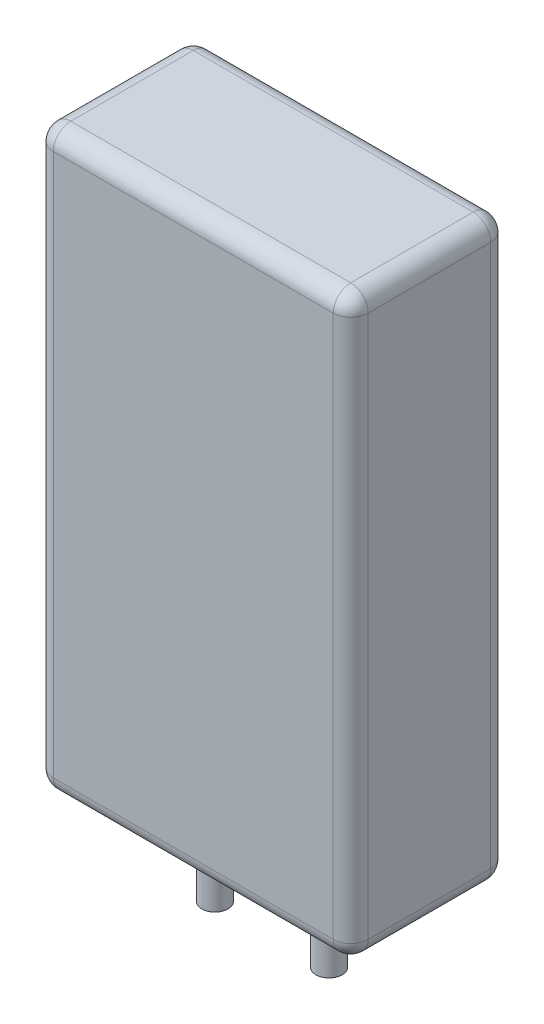
ISO-10303-21;
HEADER;
FILE_DESCRIPTION(('STEP AP214'),'2;1');
FILE_NAME('part.step','',(''),(''),'','','');
FILE_SCHEMA(('AUTOMOTIVE_DESIGN { 1 0 10303 214 1 1 1 1 }'));
ENDSEC;
DATA;
#1=APPLICATION_CONTEXT('core data for automotive mechanical design processes');
#2=APPLICATION_PROTOCOL_DEFINITION('international standard','automotive_design',2000,#1);
#3=PRODUCT_CONTEXT('',#1,'mechanical');
#4=PRODUCT('Part','Part','',(#3));
#5=PRODUCT_RELATED_PRODUCT_CATEGORY('part','',(#4));
#6=PRODUCT_DEFINITION_FORMATION('','',#4);
#7=PRODUCT_DEFINITION_CONTEXT('part definition',#1,'design');
#8=PRODUCT_DEFINITION('design','',#6,#7);
#9=PRODUCT_DEFINITION_SHAPE('','',#8);
#10=(LENGTH_UNIT() NAMED_UNIT(*) SI_UNIT(.MILLI.,.METRE.));
#11=(NAMED_UNIT(*) PLANE_ANGLE_UNIT() SI_UNIT($,.RADIAN.));
#12=(NAMED_UNIT(*) SI_UNIT($,.STERADIAN.) SOLID_ANGLE_UNIT());
#13=UNCERTAINTY_MEASURE_WITH_UNIT(LENGTH_MEASURE(1.E-05),#10,'distance_accuracy_value','');
#14=(GEOMETRIC_REPRESENTATION_CONTEXT(3) GLOBAL_UNCERTAINTY_ASSIGNED_CONTEXT((#13)) GLOBAL_UNIT_ASSIGNED_CONTEXT((#10,
#11,#12)) REPRESENTATION_CONTEXT('',''));
#15=CARTESIAN_POINT('',(0.,0.,0.));
#16=DIRECTION('',(0.,0.,1.));
#17=DIRECTION('',(1.,0.,0.));
#18=AXIS2_PLACEMENT_3D('',#15,#16,#17);
#19=CARTESIAN_POINT('',(-18.4862649870996,-22.2644628099174,18.));
#20=DIRECTION('',(0.,1.,0.));
#21=DIRECTION('',(0.,0.,1.));
#22=AXIS2_PLACEMENT_3D('',#19,#20,#21);
#23=PLANE('',#22);
#24=CARTESIAN_POINT('',(-7.00866391965159,-22.2644628099174,9.00000000000001));
#25=DIRECTION('',(0.,1.,0.));
#26=DIRECTION('',(0.,0.,1.));
#27=AXIS2_PLACEMENT_3D('',#24,#25,#26);
#28=CIRCLE('',#27,2.);
#29=CARTESIAN_POINT('',(-7.00866391965159,-22.2644628099174,11.));
#30=VERTEX_POINT('',#29);
#31=EDGE_CURVE('E42',#30,#30,#28,.F.);
#32=ORIENTED_EDGE('',*,*,#31,.F.);
#33=EDGE_LOOP('',(#32));
#34=FACE_BOUND('',#33,.T.);
#35=DIRECTION('',(0.,0.,-1.));
#36=VECTOR('',#35,1.);
#37=CARTESIAN_POINT('',(-16.4862649870996,-22.2644628099174,18.));
#38=LINE('',#37,#36);
#39=CARTESIAN_POINT('',(-16.4862649870996,-22.2644628099174,16.));
#40=VERTEX_POINT('',#39);
#41=CARTESIAN_POINT('',(-16.4862649870997,-22.2644628099174,2.));
#42=VERTEX_POINT('',#41);
#43=EDGE_CURVE('E158',#40,#42,#38,.T.);
#44=ORIENTED_EDGE('',*,*,#43,.T.);
#45=DIRECTION('',(1.,0.,0.));
#46=VECTOR('',#45,1.);
#47=CARTESIAN_POINT('',(-18.4862649870997,-22.2644628099174,2.));
#48=LINE('',#47,#46);
#49=CARTESIAN_POINT('',(15.5137350129003,-22.2644628099174,2.));
#50=VERTEX_POINT('',#49);
#51=EDGE_CURVE('E128',#42,#50,#48,.T.);
#52=ORIENTED_EDGE('',*,*,#51,.T.);
#53=DIRECTION('',(0.,0.,-1.));
#54=VECTOR('',#53,1.);
#55=CARTESIAN_POINT('',(15.5137350129003,-22.2644628099174,18.));
#56=LINE('',#55,#54);
#57=CARTESIAN_POINT('',(15.5137350129003,-22.2644628099174,16.));
#58=VERTEX_POINT('',#57);
#59=EDGE_CURVE('E147',#50,#58,#56,.F.);
#60=ORIENTED_EDGE('',*,*,#59,.T.);
#61=DIRECTION('',(1.,0.,0.));
#62=VECTOR('',#61,1.);
#63=CARTESIAN_POINT('',(-18.4862649870996,-22.2644628099174,16.));
#64=LINE('',#63,#62);
#65=EDGE_CURVE('E153',#58,#40,#64,.F.);
#66=ORIENTED_EDGE('',*,*,#65,.T.);
#67=EDGE_LOOP('',(#44,#52,#60,#66));
#68=FACE_BOUND('',#67,.T.);
#69=CARTESIAN_POINT('',(6.03613394545222,-22.2644628099174,9.00000000000001));
#70=DIRECTION('',(0.,1.,0.));
#71=DIRECTION('',(0.,0.,1.));
#72=AXIS2_PLACEMENT_3D('',#69,#70,#71);
#73=CIRCLE('',#72,2.);
#74=CARTESIAN_POINT('',(6.03613394545222,-22.2644628099174,11.));
#75=VERTEX_POINT('',#74);
#76=EDGE_CURVE('E11',#75,#75,#73,.F.);
#77=ORIENTED_EDGE('',*,*,#76,.F.);
#78=EDGE_LOOP('',(#77));
#79=FACE_BOUND('',#78,.T.);
#80=ADVANCED_FACE('F34',(#34,#68,#79),#23,.F.);
#81=CARTESIAN_POINT('',(-18.4862649870997,43.7355371900826,18.));
#82=DIRECTION('',(1.,0.,0.));
#83=DIRECTION('',(0.,1.,0.));
#84=AXIS2_PLACEMENT_3D('',#81,#82,#83);
#85=PLANE('',#84);
#86=DIRECTION('',(0.,-1.,0.));
#87=VECTOR('',#86,1.);
#88=CARTESIAN_POINT('',(-18.4862649870997,43.7355371900826,2.));
#89=LINE('',#88,#87);
#90=CARTESIAN_POINT('',(-18.4862649870997,41.7355371900826,2.));
#91=VERTEX_POINT('',#90);
#92=CARTESIAN_POINT('',(-18.4862649870997,-20.2644628099174,2.));
#93=VERTEX_POINT('',#92);
#94=EDGE_CURVE('E175',#91,#93,#89,.T.);
#95=ORIENTED_EDGE('',*,*,#94,.T.);
#96=DIRECTION('',(0.,0.,-1.));
#97=VECTOR('',#96,1.);
#98=CARTESIAN_POINT('',(-18.4862649870996,-20.2644628099174,18.));
#99=LINE('',#98,#97);
#100=CARTESIAN_POINT('',(-18.4862649870996,-20.2644628099174,16.));
#101=VERTEX_POINT('',#100);
#102=EDGE_CURVE('E177',#93,#101,#99,.F.);
#103=ORIENTED_EDGE('',*,*,#102,.T.);
#104=DIRECTION('',(0.,-1.,0.));
#105=VECTOR('',#104,1.);
#106=CARTESIAN_POINT('',(-18.4862649870997,43.7355371900826,16.));
#107=LINE('',#106,#105);
#108=CARTESIAN_POINT('',(-18.4862649870997,41.7355371900826,16.));
#109=VERTEX_POINT('',#108);
#110=EDGE_CURVE('E171',#101,#109,#107,.F.);
#111=ORIENTED_EDGE('',*,*,#110,.T.);
#112=DIRECTION('',(0.,0.,-1.));
#113=VECTOR('',#112,1.);
#114=CARTESIAN_POINT('',(-18.4862649870997,41.7355371900826,18.));
#115=LINE('',#114,#113);
#116=EDGE_CURVE('E173',#109,#91,#115,.T.);
#117=ORIENTED_EDGE('',*,*,#116,.T.);
#118=EDGE_LOOP('',(#95,#103,#111,#117));
#119=FACE_BOUND('',#118,.T.);
#120=ADVANCED_FACE('F264',(#119),#85,.F.);
#121=CARTESIAN_POINT('',(17.5137350129003,43.7355371900826,18.));
#122=DIRECTION('',(-1.,0.,0.));
#123=DIRECTION('',(0.,-1.,0.));
#124=AXIS2_PLACEMENT_3D('',#121,#122,#123);
#125=PLANE('',#124);
#126=DIRECTION('',(0.,1.,0.));
#127=VECTOR('',#126,1.);
#128=CARTESIAN_POINT('',(17.5137350129003,-22.2644628099174,16.));
#129=LINE('',#128,#127);
#130=CARTESIAN_POINT('',(17.5137350129003,41.7355371900826,16.));
#131=VERTEX_POINT('',#130);
#132=CARTESIAN_POINT('',(17.5137350129003,-20.2644628099174,16.));
#133=VERTEX_POINT('',#132);
#134=EDGE_CURVE('E49',#131,#133,#129,.F.);
#135=ORIENTED_EDGE('',*,*,#134,.T.);
#136=DIRECTION('',(0.,0.,-1.));
#137=VECTOR('',#136,1.);
#138=CARTESIAN_POINT('',(17.5137350129003,-20.2644628099174,18.));
#139=LINE('',#138,#137);
#140=CARTESIAN_POINT('',(17.5137350129003,-20.2644628099174,2.));
#141=VERTEX_POINT('',#140);
#142=EDGE_CURVE('E202',#133,#141,#139,.T.);
#143=ORIENTED_EDGE('',*,*,#142,.T.);
#144=DIRECTION('',(0.,1.,0.));
#145=VECTOR('',#144,1.);
#146=CARTESIAN_POINT('',(17.5137350129003,43.7355371900826,2.));
#147=LINE('',#146,#145);
#148=CARTESIAN_POINT('',(17.5137350129003,41.7355371900826,2.));
#149=VERTEX_POINT('',#148);
#150=EDGE_CURVE('E198',#141,#149,#147,.T.);
#151=ORIENTED_EDGE('',*,*,#150,.T.);
#152=DIRECTION('',(0.,0.,-1.));
#153=VECTOR('',#152,1.);
#154=CARTESIAN_POINT('',(17.5137350129003,41.7355371900826,18.));
#155=LINE('',#154,#153);
#156=EDGE_CURVE('E54',#149,#131,#155,.F.);
#157=ORIENTED_EDGE('',*,*,#156,.T.);
#158=EDGE_LOOP('',(#135,#143,#151,#157));
#159=FACE_BOUND('',#158,.T.);
#160=ADVANCED_FACE('F269',(#159),#125,.F.);
#161=CARTESIAN_POINT('',(-18.4862649870997,43.7355371900826,18.));
#162=DIRECTION('',(0.,-1.,0.));
#163=DIRECTION('',(0.,0.,-1.));
#164=AXIS2_PLACEMENT_3D('',#161,#162,#163);
#165=PLANE('',#164);
#166=DIRECTION('',(-1.,0.,0.));
#167=VECTOR('',#166,1.);
#168=CARTESIAN_POINT('',(-18.4862649870997,43.7355371900826,2.));
#169=LINE('',#168,#167);
#170=CARTESIAN_POINT('',(15.5137350129003,43.7355371900826,2.));
#171=VERTEX_POINT('',#170);
#172=CARTESIAN_POINT('',(-16.4862649870997,43.7355371900826,2.));
#173=VERTEX_POINT('',#172);
#174=EDGE_CURVE('E184',#171,#173,#169,.T.);
#175=ORIENTED_EDGE('',*,*,#174,.T.);
#176=DIRECTION('',(0.,0.,-1.));
#177=VECTOR('',#176,1.);
#178=CARTESIAN_POINT('',(-16.4862649870997,43.7355371900826,18.));
#179=LINE('',#178,#177);
#180=CARTESIAN_POINT('',(-16.4862649870997,43.7355371900826,16.));
#181=VERTEX_POINT('',#180);
#182=EDGE_CURVE('E186',#173,#181,#179,.F.);
#183=ORIENTED_EDGE('',*,*,#182,.T.);
#184=DIRECTION('',(-1.,0.,0.));
#185=VECTOR('',#184,1.);
#186=CARTESIAN_POINT('',(17.5137350129003,43.7355371900826,16.));
#187=LINE('',#186,#185);
#188=CARTESIAN_POINT('',(15.5137350129003,43.7355371900826,16.));
#189=VERTEX_POINT('',#188);
#190=EDGE_CURVE('E182',#181,#189,#187,.F.);
#191=ORIENTED_EDGE('',*,*,#190,.T.);
#192=DIRECTION('',(0.,0.,-1.));
#193=VECTOR('',#192,1.);
#194=CARTESIAN_POINT('',(15.5137350129003,43.7355371900826,18.));
#195=LINE('',#194,#193);
#196=EDGE_CURVE('E180',#189,#171,#195,.T.);
#197=ORIENTED_EDGE('',*,*,#196,.T.);
#198=EDGE_LOOP('',(#175,#183,#191,#197));
#199=FACE_BOUND('',#198,.T.);
#200=ADVANCED_FACE('F378',(#199),#165,.F.);
#201=CARTESIAN_POINT('',(0.,0.,18.));
#202=DIRECTION('',(0.,0.,1.));
#203=DIRECTION('',(1.,0.,0.));
#204=AXIS2_PLACEMENT_3D('',#201,#202,#203);
#205=PLANE('',#204);
#206=DIRECTION('',(-1.,0.,0.));
#207=VECTOR('',#206,1.);
#208=CARTESIAN_POINT('',(-18.4862649870997,41.7355371900826,18.));
#209=LINE('',#208,#207);
#210=CARTESIAN_POINT('',(15.5137350129003,41.7355371900826,18.));
#211=VERTEX_POINT('',#210);
#212=CARTESIAN_POINT('',(-16.4862649870997,41.7355371900826,18.));
#213=VERTEX_POINT('',#212);
#214=EDGE_CURVE('E193',#211,#213,#209,.T.);
#215=ORIENTED_EDGE('',*,*,#214,.T.);
#216=DIRECTION('',(0.,-1.,0.));
#217=VECTOR('',#216,1.);
#218=CARTESIAN_POINT('',(-16.4862649870996,-22.2644628099174,18.));
#219=LINE('',#218,#217);
#220=CARTESIAN_POINT('',(-16.4862649870996,-20.2644628099174,18.));
#221=VERTEX_POINT('',#220);
#222=EDGE_CURVE('E196',#213,#221,#219,.T.);
#223=ORIENTED_EDGE('',*,*,#222,.T.);
#224=DIRECTION('',(1.,0.,0.));
#225=VECTOR('',#224,1.);
#226=CARTESIAN_POINT('',(17.5137350129003,-20.2644628099174,18.));
#227=LINE('',#226,#225);
#228=CARTESIAN_POINT('',(15.5137350129003,-20.2644628099174,18.));
#229=VERTEX_POINT('',#228);
#230=EDGE_CURVE('E191',#221,#229,#227,.T.);
#231=ORIENTED_EDGE('',*,*,#230,.T.);
#232=DIRECTION('',(0.,1.,0.));
#233=VECTOR('',#232,1.);
#234=CARTESIAN_POINT('',(15.5137350129003,43.7355371900826,18.));
#235=LINE('',#234,#233);
#236=EDGE_CURVE('E189',#229,#211,#235,.T.);
#237=ORIENTED_EDGE('',*,*,#236,.T.);
#238=EDGE_LOOP('',(#215,#223,#231,#237));
#239=FACE_BOUND('',#238,.T.);
#240=ADVANCED_FACE('F358',(#239),#205,.T.);
#241=CARTESIAN_POINT('',(0.,0.,0.));
#242=DIRECTION('',(0.,0.,1.));
#243=DIRECTION('',(1.,0.,0.));
#244=AXIS2_PLACEMENT_3D('',#241,#242,#243);
#245=PLANE('',#244);
#246=DIRECTION('',(0.,1.,0.));
#247=VECTOR('',#246,1.);
#248=CARTESIAN_POINT('',(15.5137350129003,0.,0.));
#249=LINE('',#248,#247);
#250=CARTESIAN_POINT('',(15.5137350129003,41.7355371900826,0.));
#251=VERTEX_POINT('',#250);
#252=CARTESIAN_POINT('',(15.5137350129003,-20.2644628099174,0.));
#253=VERTEX_POINT('',#252);
#254=EDGE_CURVE('E160',#251,#253,#249,.F.);
#255=ORIENTED_EDGE('',*,*,#254,.T.);
#256=DIRECTION('',(1.,0.,0.));
#257=VECTOR('',#256,1.);
#258=CARTESIAN_POINT('',(0.,-20.2644628099174,0.));
#259=LINE('',#258,#257);
#260=CARTESIAN_POINT('',(-16.4862649870997,-20.2644628099174,0.));
#261=VERTEX_POINT('',#260);
#262=EDGE_CURVE('E130',#253,#261,#259,.F.);
#263=ORIENTED_EDGE('',*,*,#262,.T.);
#264=DIRECTION('',(0.,-1.,0.));
#265=VECTOR('',#264,1.);
#266=CARTESIAN_POINT('',(-16.4862649870997,0.,0.));
#267=LINE('',#266,#265);
#268=CARTESIAN_POINT('',(-16.4862649870997,41.7355371900826,0.));
#269=VERTEX_POINT('',#268);
#270=EDGE_CURVE('E168',#261,#269,#267,.F.);
#271=ORIENTED_EDGE('',*,*,#270,.T.);
#272=DIRECTION('',(-1.,0.,0.));
#273=VECTOR('',#272,1.);
#274=CARTESIAN_POINT('',(0.,41.7355371900826,0.));
#275=LINE('',#274,#273);
#276=EDGE_CURVE('E162',#269,#251,#275,.F.);
#277=ORIENTED_EDGE('',*,*,#276,.T.);
#278=EDGE_LOOP('',(#255,#263,#271,#277));
#279=FACE_BOUND('',#278,.T.);
#280=ADVANCED_FACE('F347',(#279),#245,.F.);
#281=CARTESIAN_POINT('',(0.,41.7355371900826,16.));
#282=DIRECTION('',(1.,0.,0.));
#283=DIRECTION('',(0.,0.,-1.));
#284=AXIS2_PLACEMENT_3D('',#281,#282,#283);
#285=CYLINDRICAL_SURFACE('',#284,2.);
#286=CARTESIAN_POINT('',(-16.4862649870997,41.7355371900826,16.));
#287=DIRECTION('',(-1.,0.,0.));
#288=DIRECTION('',(0.,0.,1.));
#289=AXIS2_PLACEMENT_3D('',#286,#287,#288);
#290=CIRCLE('',#289,2.);
#291=EDGE_CURVE('E154',#213,#181,#290,.T.);
#292=ORIENTED_EDGE('',*,*,#291,.F.);
#293=ORIENTED_EDGE('',*,*,#214,.F.);
#294=CARTESIAN_POINT('',(15.5137350129003,41.7355371900826,16.));
#295=DIRECTION('',(1.,0.,0.));
#296=DIRECTION('',(0.,0.,-1.));
#297=AXIS2_PLACEMENT_3D('',#294,#295,#296);
#298=CIRCLE('',#297,2.);
#299=EDGE_CURVE('E254',#189,#211,#298,.T.);
#300=ORIENTED_EDGE('',*,*,#299,.F.);
#301=ORIENTED_EDGE('',*,*,#190,.F.);
#302=EDGE_LOOP('',(#292,#293,#300,#301));
#303=FACE_BOUND('',#302,.T.);
#304=ADVANCED_FACE('F36',(#303),#285,.T.);
#305=CARTESIAN_POINT('',(-16.4862649870997,41.7355371900826,16.));
#306=DIRECTION('',(0.,0.,1.));
#307=DIRECTION('',(1.,0.,0.));
#308=AXIS2_PLACEMENT_3D('',#305,#306,#307);
#309=SPHERICAL_SURFACE('',#308,2.);
#310=CARTESIAN_POINT('',(-16.4862649870997,41.7355371900826,16.));
#311=DIRECTION('',(0.,1.,0.));
#312=DIRECTION('',(0.,0.,1.));
#313=AXIS2_PLACEMENT_3D('',#310,#311,#312);
#314=CIRCLE('',#313,2.);
#315=EDGE_CURVE('E249',#213,#109,#314,.F.);
#316=ORIENTED_EDGE('',*,*,#315,.F.);
#317=ORIENTED_EDGE('',*,*,#291,.T.);
#318=CARTESIAN_POINT('',(-16.4862649870997,41.7355371900826,16.));
#319=DIRECTION('',(0.,0.,1.));
#320=DIRECTION('',(1.,0.,0.));
#321=AXIS2_PLACEMENT_3D('',#318,#319,#320);
#322=CIRCLE('',#321,2.);
#323=EDGE_CURVE('E252',#109,#181,#322,.F.);
#324=ORIENTED_EDGE('',*,*,#323,.F.);
#325=EDGE_LOOP('',(#316,#317,#324));
#326=FACE_BOUND('',#325,.T.);
#327=ADVANCED_FACE('F340',(#326),#309,.T.);
#328=CARTESIAN_POINT('',(15.5137350129003,41.7355371900826,16.));
#329=DIRECTION('',(0.,0.,1.));
#330=DIRECTION('',(1.,0.,0.));
#331=AXIS2_PLACEMENT_3D('',#328,#329,#330);
#332=SPHERICAL_SURFACE('',#331,2.);
#333=CARTESIAN_POINT('',(15.5137350129003,41.7355371900826,16.));
#334=DIRECTION('',(0.,0.,1.));
#335=DIRECTION('',(1.,0.,0.));
#336=AXIS2_PLACEMENT_3D('',#333,#334,#335);
#337=CIRCLE('',#336,2.);
#338=EDGE_CURVE('E244',#189,#131,#337,.F.);
#339=ORIENTED_EDGE('',*,*,#338,.F.);
#340=ORIENTED_EDGE('',*,*,#299,.T.);
#341=CARTESIAN_POINT('',(15.5137350129003,41.7355371900826,16.));
#342=DIRECTION('',(0.,1.,0.));
#343=DIRECTION('',(0.,0.,1.));
#344=AXIS2_PLACEMENT_3D('',#341,#342,#343);
#345=CIRCLE('',#344,2.);
#346=EDGE_CURVE('E246',#131,#211,#345,.F.);
#347=ORIENTED_EDGE('',*,*,#346,.F.);
#348=EDGE_LOOP('',(#339,#340,#347));
#349=FACE_BOUND('',#348,.T.);
#350=ADVANCED_FACE('F337',(#349),#332,.T.);
#351=CARTESIAN_POINT('',(-16.4862649870997,41.7355371900826,18.));
#352=DIRECTION('',(0.,0.,-1.));
#353=DIRECTION('',(-1.,0.,0.));
#354=AXIS2_PLACEMENT_3D('',#351,#352,#353);
#355=CYLINDRICAL_SURFACE('',#354,2.);
#356=ORIENTED_EDGE('',*,*,#323,.T.);
#357=ORIENTED_EDGE('',*,*,#182,.F.);
#358=CARTESIAN_POINT('',(-16.4862649870997,41.7355371900826,2.));
#359=DIRECTION('',(0.,0.,-1.));
#360=DIRECTION('',(-1.,0.,0.));
#361=AXIS2_PLACEMENT_3D('',#358,#359,#360);
#362=CIRCLE('',#361,2.);
#363=EDGE_CURVE('E238',#91,#173,#362,.T.);
#364=ORIENTED_EDGE('',*,*,#363,.F.);
#365=ORIENTED_EDGE('',*,*,#116,.F.);
#366=EDGE_LOOP('',(#356,#357,#364,#365));
#367=FACE_BOUND('',#366,.T.);
#368=ADVANCED_FACE('F333',(#367),#355,.T.);
#369=CARTESIAN_POINT('',(-16.4862649870997,0.,16.));
#370=DIRECTION('',(0.,1.,0.));
#371=DIRECTION('',(-1.,0.,0.));
#372=AXIS2_PLACEMENT_3D('',#369,#370,#371);
#373=CYLINDRICAL_SURFACE('',#372,2.);
#374=ORIENTED_EDGE('',*,*,#315,.T.);
#375=ORIENTED_EDGE('',*,*,#110,.F.);
#376=CARTESIAN_POINT('',(-16.4862649870996,-20.2644628099174,16.));
#377=DIRECTION('',(0.,-1.,0.));
#378=DIRECTION('',(0.,0.,-1.));
#379=AXIS2_PLACEMENT_3D('',#376,#377,#378);
#380=CIRCLE('',#379,2.);
#381=EDGE_CURVE('E235',#221,#101,#380,.T.);
#382=ORIENTED_EDGE('',*,*,#381,.F.);
#383=ORIENTED_EDGE('',*,*,#222,.F.);
#384=EDGE_LOOP('',(#374,#375,#382,#383));
#385=FACE_BOUND('',#384,.T.);
#386=ADVANCED_FACE('F329',(#385),#373,.T.);
#387=CARTESIAN_POINT('',(0.,-20.2644628099174,16.));
#388=DIRECTION('',(-1.,0.,0.));
#389=DIRECTION('',(0.,0.,1.));
#390=AXIS2_PLACEMENT_3D('',#387,#388,#389);
#391=CYLINDRICAL_SURFACE('',#390,2.);
#392=CARTESIAN_POINT('',(15.5137350129003,-20.2644628099174,16.));
#393=DIRECTION('',(1.,0.,0.));
#394=DIRECTION('',(0.,0.,-1.));
#395=AXIS2_PLACEMENT_3D('',#392,#393,#394);
#396=CIRCLE('',#395,2.);
#397=EDGE_CURVE('E229',#229,#58,#396,.T.);
#398=ORIENTED_EDGE('',*,*,#397,.F.);
#399=ORIENTED_EDGE('',*,*,#230,.F.);
#400=CARTESIAN_POINT('',(-16.4862649870996,-20.2644628099174,16.));
#401=DIRECTION('',(-1.,0.,0.));
#402=DIRECTION('',(0.,0.,1.));
#403=AXIS2_PLACEMENT_3D('',#400,#401,#402);
#404=CIRCLE('',#403,2.);
#405=EDGE_CURVE('E232',#40,#221,#404,.T.);
#406=ORIENTED_EDGE('',*,*,#405,.F.);
#407=ORIENTED_EDGE('',*,*,#65,.F.);
#408=EDGE_LOOP('',(#398,#399,#406,#407));
#409=FACE_BOUND('',#408,.T.);
#410=ADVANCED_FACE('F325',(#409),#391,.T.);
#411=CARTESIAN_POINT('',(15.5137350129003,0.,16.));
#412=DIRECTION('',(0.,-1.,0.));
#413=DIRECTION('',(1.,0.,0.));
#414=AXIS2_PLACEMENT_3D('',#411,#412,#413);
#415=CYLINDRICAL_SURFACE('',#414,2.);
#416=ORIENTED_EDGE('',*,*,#346,.T.);
#417=ORIENTED_EDGE('',*,*,#236,.F.);
#418=CARTESIAN_POINT('',(15.5137350129003,-20.2644628099174,16.));
#419=DIRECTION('',(0.,-1.,0.));
#420=DIRECTION('',(0.,0.,-1.));
#421=AXIS2_PLACEMENT_3D('',#418,#419,#420);
#422=CIRCLE('',#421,2.);
#423=EDGE_CURVE('E226',#133,#229,#422,.T.);
#424=ORIENTED_EDGE('',*,*,#423,.F.);
#425=ORIENTED_EDGE('',*,*,#134,.F.);
#426=EDGE_LOOP('',(#416,#417,#424,#425));
#427=FACE_BOUND('',#426,.T.);
#428=ADVANCED_FACE('F321',(#427),#415,.T.);
#429=CARTESIAN_POINT('',(15.5137350129003,41.7355371900826,18.));
#430=DIRECTION('',(0.,0.,-1.));
#431=DIRECTION('',(-1.,0.,0.));
#432=AXIS2_PLACEMENT_3D('',#429,#430,#431);
#433=CYLINDRICAL_SURFACE('',#432,2.);
#434=ORIENTED_EDGE('',*,*,#338,.T.);
#435=ORIENTED_EDGE('',*,*,#156,.F.);
#436=CARTESIAN_POINT('',(15.5137350129003,41.7355371900826,2.));
#437=DIRECTION('',(0.,0.,-1.));
#438=DIRECTION('',(-1.,0.,0.));
#439=AXIS2_PLACEMENT_3D('',#436,#437,#438);
#440=CIRCLE('',#439,2.);
#441=EDGE_CURVE('E223',#171,#149,#440,.T.);
#442=ORIENTED_EDGE('',*,*,#441,.F.);
#443=ORIENTED_EDGE('',*,*,#196,.F.);
#444=EDGE_LOOP('',(#434,#435,#442,#443));
#445=FACE_BOUND('',#444,.T.);
#446=ADVANCED_FACE('F317',(#445),#433,.T.);
#447=CARTESIAN_POINT('',(-18.4862649870997,41.7355371900826,2.));
#448=DIRECTION('',(-1.,0.,0.));
#449=DIRECTION('',(0.,0.,1.));
#450=AXIS2_PLACEMENT_3D('',#447,#448,#449);
#451=CYLINDRICAL_SURFACE('',#450,2.);
#452=CARTESIAN_POINT('',(-16.4862649870997,41.7355371900826,2.));
#453=DIRECTION('',(-1.,0.,0.));
#454=DIRECTION('',(0.,0.,1.));
#455=AXIS2_PLACEMENT_3D('',#452,#453,#454);
#456=CIRCLE('',#455,2.);
#457=EDGE_CURVE('E241',#173,#269,#456,.T.);
#458=ORIENTED_EDGE('',*,*,#457,.F.);
#459=ORIENTED_EDGE('',*,*,#174,.F.);
#460=CARTESIAN_POINT('',(15.5137350129003,41.7355371900826,2.));
#461=DIRECTION('',(1.,0.,0.));
#462=DIRECTION('',(0.,1.,0.));
#463=AXIS2_PLACEMENT_3D('',#460,#461,#462);
#464=CIRCLE('',#463,2.);
#465=EDGE_CURVE('E220',#251,#171,#464,.T.);
#466=ORIENTED_EDGE('',*,*,#465,.F.);
#467=ORIENTED_EDGE('',*,*,#276,.F.);
#468=EDGE_LOOP('',(#458,#459,#466,#467));
#469=FACE_BOUND('',#468,.T.);
#470=ADVANCED_FACE('F313',(#469),#451,.T.);
#471=CARTESIAN_POINT('',(-16.4862649870997,41.7355371900826,2.));
#472=DIRECTION('',(0.,0.,1.));
#473=DIRECTION('',(1.,0.,0.));
#474=AXIS2_PLACEMENT_3D('',#471,#472,#473);
#475=SPHERICAL_SURFACE('',#474,2.);
#476=ORIENTED_EDGE('',*,*,#363,.T.);
#477=ORIENTED_EDGE('',*,*,#457,.T.);
#478=CARTESIAN_POINT('',(-16.4862649870997,41.7355371900826,2.));
#479=DIRECTION('',(0.,1.,0.));
#480=DIRECTION('',(0.,0.,1.));
#481=AXIS2_PLACEMENT_3D('',#478,#479,#480);
#482=CIRCLE('',#481,2.);
#483=EDGE_CURVE('E217',#91,#269,#482,.F.);
#484=ORIENTED_EDGE('',*,*,#483,.F.);
#485=EDGE_LOOP('',(#476,#477,#484));
#486=FACE_BOUND('',#485,.T.);
#487=ADVANCED_FACE('F309',(#486),#475,.T.);
#488=CARTESIAN_POINT('',(-16.4862649870996,-20.2644628099174,16.));
#489=DIRECTION('',(0.,0.,1.));
#490=DIRECTION('',(1.,0.,0.));
#491=AXIS2_PLACEMENT_3D('',#488,#489,#490);
#492=SPHERICAL_SURFACE('',#491,2.);
#493=ORIENTED_EDGE('',*,*,#405,.T.);
#494=ORIENTED_EDGE('',*,*,#381,.T.);
#495=CARTESIAN_POINT('',(-16.4862649870996,-20.2644628099174,16.));
#496=DIRECTION('',(0.,0.,1.));
#497=DIRECTION('',(1.,0.,0.));
#498=AXIS2_PLACEMENT_3D('',#495,#496,#497);
#499=CIRCLE('',#498,2.);
#500=EDGE_CURVE('E215',#40,#101,#499,.F.);
#501=ORIENTED_EDGE('',*,*,#500,.F.);
#502=EDGE_LOOP('',(#493,#494,#501));
#503=FACE_BOUND('',#502,.T.);
#504=ADVANCED_FACE('F305',(#503),#492,.T.);
#505=CARTESIAN_POINT('',(15.5137350129003,-20.2644628099174,16.));
#506=DIRECTION('',(0.,0.,1.));
#507=DIRECTION('',(1.,0.,0.));
#508=AXIS2_PLACEMENT_3D('',#505,#506,#507);
#509=SPHERICAL_SURFACE('',#508,2.);
#510=ORIENTED_EDGE('',*,*,#423,.T.);
#511=ORIENTED_EDGE('',*,*,#397,.T.);
#512=CARTESIAN_POINT('',(15.5137350129003,-20.2644628099174,16.));
#513=DIRECTION('',(0.,0.,1.));
#514=DIRECTION('',(1.,0.,0.));
#515=AXIS2_PLACEMENT_3D('',#512,#513,#514);
#516=CIRCLE('',#515,2.);
#517=EDGE_CURVE('E150',#133,#58,#516,.F.);
#518=ORIENTED_EDGE('',*,*,#517,.F.);
#519=EDGE_LOOP('',(#510,#511,#518));
#520=FACE_BOUND('',#519,.T.);
#521=ADVANCED_FACE('F301',(#520),#509,.T.);
#522=CARTESIAN_POINT('',(15.5137350129003,41.7355371900826,2.));
#523=DIRECTION('',(0.,0.,1.));
#524=DIRECTION('',(1.,0.,0.));
#525=AXIS2_PLACEMENT_3D('',#522,#523,#524);
#526=SPHERICAL_SURFACE('',#525,2.);
#527=ORIENTED_EDGE('',*,*,#465,.T.);
#528=ORIENTED_EDGE('',*,*,#441,.T.);
#529=CARTESIAN_POINT('',(15.5137350129003,41.7355371900826,2.));
#530=DIRECTION('',(0.,1.,0.));
#531=DIRECTION('',(0.,0.,1.));
#532=AXIS2_PLACEMENT_3D('',#529,#530,#531);
#533=CIRCLE('',#532,2.);
#534=EDGE_CURVE('E211',#251,#149,#533,.F.);
#535=ORIENTED_EDGE('',*,*,#534,.F.);
#536=EDGE_LOOP('',(#527,#528,#535));
#537=FACE_BOUND('',#536,.T.);
#538=ADVANCED_FACE('F297',(#537),#526,.T.);
#539=CARTESIAN_POINT('',(-16.4862649870997,43.7355371900826,2.));
#540=DIRECTION('',(0.,-1.,0.));
#541=DIRECTION('',(1.,0.,0.));
#542=AXIS2_PLACEMENT_3D('',#539,#540,#541);
#543=CYLINDRICAL_SURFACE('',#542,2.);
#544=ORIENTED_EDGE('',*,*,#483,.T.);
#545=ORIENTED_EDGE('',*,*,#270,.F.);
#546=CARTESIAN_POINT('',(-16.4862649870997,-20.2644628099174,2.));
#547=DIRECTION('',(0.,-1.,0.));
#548=DIRECTION('',(0.,0.,-1.));
#549=AXIS2_PLACEMENT_3D('',#546,#547,#548);
#550=CIRCLE('',#549,2.);
#551=EDGE_CURVE('E208',#93,#261,#550,.T.);
#552=ORIENTED_EDGE('',*,*,#551,.F.);
#553=ORIENTED_EDGE('',*,*,#94,.F.);
#554=EDGE_LOOP('',(#544,#545,#552,#553));
#555=FACE_BOUND('',#554,.T.);
#556=ADVANCED_FACE('F293',(#555),#543,.T.);
#557=CARTESIAN_POINT('',(-16.4862649870996,-20.2644628099174,18.));
#558=DIRECTION('',(0.,0.,-1.));
#559=DIRECTION('',(-1.,0.,0.));
#560=AXIS2_PLACEMENT_3D('',#557,#558,#559);
#561=CYLINDRICAL_SURFACE('',#560,2.);
#562=ORIENTED_EDGE('',*,*,#500,.T.);
#563=ORIENTED_EDGE('',*,*,#102,.F.);
#564=CARTESIAN_POINT('',(-16.4862649870997,-20.2644628099174,2.));
#565=DIRECTION('',(0.,0.,-1.));
#566=DIRECTION('',(-1.,0.,0.));
#567=AXIS2_PLACEMENT_3D('',#564,#565,#566);
#568=CIRCLE('',#567,2.);
#569=EDGE_CURVE('E144',#42,#93,#568,.T.);
#570=ORIENTED_EDGE('',*,*,#569,.F.);
#571=ORIENTED_EDGE('',*,*,#43,.F.);
#572=EDGE_LOOP('',(#562,#563,#570,#571));
#573=FACE_BOUND('',#572,.T.);
#574=ADVANCED_FACE('F290',(#573),#561,.T.);
#575=CARTESIAN_POINT('',(15.5137350129003,-20.2644628099174,18.));
#576=DIRECTION('',(0.,0.,-1.));
#577=DIRECTION('',(-1.,0.,0.));
#578=AXIS2_PLACEMENT_3D('',#575,#576,#577);
#579=CYLINDRICAL_SURFACE('',#578,2.);
#580=ORIENTED_EDGE('',*,*,#517,.T.);
#581=ORIENTED_EDGE('',*,*,#59,.F.);
#582=CARTESIAN_POINT('',(15.5137350129003,-20.2644628099174,2.));
#583=DIRECTION('',(0.,0.,-1.));
#584=DIRECTION('',(-1.,0.,0.));
#585=AXIS2_PLACEMENT_3D('',#582,#583,#584);
#586=CIRCLE('',#585,2.);
#587=EDGE_CURVE('E136',#141,#50,#586,.T.);
#588=ORIENTED_EDGE('',*,*,#587,.F.);
#589=ORIENTED_EDGE('',*,*,#142,.F.);
#590=EDGE_LOOP('',(#580,#581,#588,#589));
#591=FACE_BOUND('',#590,.T.);
#592=ADVANCED_FACE('F148',(#591),#579,.T.);
#593=CARTESIAN_POINT('',(15.5137350129003,43.7355371900826,2.));
#594=DIRECTION('',(0.,1.,0.));
#595=DIRECTION('',(-1.,0.,0.));
#596=AXIS2_PLACEMENT_3D('',#593,#594,#595);
#597=CYLINDRICAL_SURFACE('',#596,2.);
#598=ORIENTED_EDGE('',*,*,#534,.T.);
#599=ORIENTED_EDGE('',*,*,#150,.F.);
#600=CARTESIAN_POINT('',(15.5137350129003,-20.2644628099174,2.));
#601=DIRECTION('',(0.,-1.,0.));
#602=DIRECTION('',(0.,0.,-1.));
#603=AXIS2_PLACEMENT_3D('',#600,#601,#602);
#604=CIRCLE('',#603,2.);
#605=EDGE_CURVE('E140',#253,#141,#604,.T.);
#606=ORIENTED_EDGE('',*,*,#605,.F.);
#607=ORIENTED_EDGE('',*,*,#254,.F.);
#608=EDGE_LOOP('',(#598,#599,#606,#607));
#609=FACE_BOUND('',#608,.T.);
#610=ADVANCED_FACE('F283',(#609),#597,.T.);
#611=CARTESIAN_POINT('',(-16.4862649870997,-20.2644628099174,2.));
#612=DIRECTION('',(0.,0.,1.));
#613=DIRECTION('',(1.,0.,0.));
#614=AXIS2_PLACEMENT_3D('',#611,#612,#613);
#615=SPHERICAL_SURFACE('',#614,2.);
#616=ORIENTED_EDGE('',*,*,#569,.T.);
#617=ORIENTED_EDGE('',*,*,#551,.T.);
#618=CARTESIAN_POINT('',(-16.4862649870997,-20.2644628099174,2.));
#619=DIRECTION('',(-1.,0.,0.));
#620=DIRECTION('',(0.,0.,1.));
#621=AXIS2_PLACEMENT_3D('',#618,#619,#620);
#622=CIRCLE('',#621,2.);
#623=EDGE_CURVE('E132',#42,#261,#622,.F.);
#624=ORIENTED_EDGE('',*,*,#623,.F.);
#625=EDGE_LOOP('',(#616,#617,#624));
#626=FACE_BOUND('',#625,.T.);
#627=ADVANCED_FACE('F280',(#626),#615,.T.);
#628=CARTESIAN_POINT('',(15.5137350129003,-20.2644628099174,2.));
#629=DIRECTION('',(0.,0.,1.));
#630=DIRECTION('',(1.,0.,0.));
#631=AXIS2_PLACEMENT_3D('',#628,#629,#630);
#632=SPHERICAL_SURFACE('',#631,2.);
#633=ORIENTED_EDGE('',*,*,#605,.T.);
#634=ORIENTED_EDGE('',*,*,#587,.T.);
#635=CARTESIAN_POINT('',(15.5137350129003,-20.2644628099174,2.));
#636=DIRECTION('',(1.,0.,0.));
#637=DIRECTION('',(0.,0.,-1.));
#638=AXIS2_PLACEMENT_3D('',#635,#636,#637);
#639=CIRCLE('',#638,2.);
#640=EDGE_CURVE('E124',#253,#50,#639,.F.);
#641=ORIENTED_EDGE('',*,*,#640,.F.);
#642=EDGE_LOOP('',(#633,#634,#641));
#643=FACE_BOUND('',#642,.T.);
#644=ADVANCED_FACE('F138',(#643),#632,.T.);
#645=CARTESIAN_POINT('',(-18.4862649870997,-20.2644628099174,2.));
#646=DIRECTION('',(1.,0.,0.));
#647=DIRECTION('',(0.,0.,-1.));
#648=AXIS2_PLACEMENT_3D('',#645,#646,#647);
#649=CYLINDRICAL_SURFACE('',#648,2.);
#650=ORIENTED_EDGE('',*,*,#623,.T.);
#651=ORIENTED_EDGE('',*,*,#262,.F.);
#652=ORIENTED_EDGE('',*,*,#640,.T.);
#653=ORIENTED_EDGE('',*,*,#51,.F.);
#654=EDGE_LOOP('',(#650,#651,#652,#653));
#655=FACE_BOUND('',#654,.T.);
#656=ADVANCED_FACE('F126',(#655),#649,.T.);
#657=CARTESIAN_POINT('',(-7.00866391965159,-27.2644628099174,9.00000000000001));
#658=DIRECTION('',(0.,-1.,0.));
#659=DIRECTION('',(0.,0.,-1.));
#660=AXIS2_PLACEMENT_3D('',#657,#658,#659);
#661=PLANE('',#660);
#662=CARTESIAN_POINT('',(-7.00866391965159,-27.2644628099174,9.00000000000001));
#663=DIRECTION('',(0.,-1.,0.));
#664=DIRECTION('',(0.,0.,-1.));
#665=AXIS2_PLACEMENT_3D('',#662,#663,#664);
#666=CIRCLE('',#665,2.);
#667=CARTESIAN_POINT('',(-7.00866391965159,-27.2644628099174,7.00000000000001));
#668=VERTEX_POINT('',#667);
#669=EDGE_CURVE('E439',#668,#668,#666,.T.);
#670=ORIENTED_EDGE('',*,*,#669,.T.);
#671=EDGE_LOOP('',(#670));
#672=FACE_BOUND('',#671,.T.);
#673=CARTESIAN_POINT('',(-7.00866391965159,-27.2644628099174,9.00000000000001));
#674=DIRECTION('',(0.,-1.,0.));
#675=DIRECTION('',(0.,0.,-1.));
#676=AXIS2_PLACEMENT_3D('',#673,#674,#675);
#677=CIRCLE('',#676,1.5);
#678=CARTESIAN_POINT('',(-7.00866391965159,-27.2644628099174,7.50000000000001));
#679=VERTEX_POINT('',#678);
#680=EDGE_CURVE('E434',#679,#679,#677,.T.);
#681=ORIENTED_EDGE('',*,*,#680,.F.);
#682=EDGE_LOOP('',(#681));
#683=FACE_BOUND('',#682,.T.);
#684=ADVANCED_FACE('F277',(#672,#683),#661,.T.);
#685=CARTESIAN_POINT('',(-7.00866391965159,-27.2644628099174,9.00000000000001));
#686=DIRECTION('',(0.,1.,0.));
#687=DIRECTION('',(0.,0.,1.));
#688=AXIS2_PLACEMENT_3D('',#685,#686,#687);
#689=CYLINDRICAL_SURFACE('',#688,2.);
#690=ORIENTED_EDGE('',*,*,#669,.F.);
#691=EDGE_LOOP('',(#690));
#692=FACE_BOUND('',#691,.T.);
#693=ORIENTED_EDGE('',*,*,#31,.T.);
#694=EDGE_LOOP('',(#693));
#695=FACE_BOUND('',#694,.T.);
#696=ADVANCED_FACE('F261',(#692,#695),#689,.T.);
#697=CARTESIAN_POINT('',(-7.00866391965159,-32.2644628099174,9.00000000000001));
#698=DIRECTION('',(0.,-1.,0.));
#699=DIRECTION('',(0.,0.,-1.));
#700=AXIS2_PLACEMENT_3D('',#697,#698,#699);
#701=PLANE('',#700);
#702=CARTESIAN_POINT('',(-7.00866391965159,-32.2644628099174,9.00000000000001));
#703=DIRECTION('',(0.,-1.,0.));
#704=DIRECTION('',(0.,0.,-1.));
#705=AXIS2_PLACEMENT_3D('',#702,#703,#704);
#706=CIRCLE('',#705,1.5);
#707=CARTESIAN_POINT('',(-7.00866391965159,-32.2644628099174,7.50000000000001));
#708=VERTEX_POINT('',#707);
#709=EDGE_CURVE('E133',#708,#708,#706,.T.);
#710=ORIENTED_EDGE('',*,*,#709,.T.);
#711=EDGE_LOOP('',(#710));
#712=FACE_BOUND('',#711,.T.);
#713=ADVANCED_FACE('F399',(#712),#701,.T.);
#714=CARTESIAN_POINT('',(-7.00866391965159,-32.2644628099174,9.00000000000001));
#715=DIRECTION('',(0.,1.,0.));
#716=DIRECTION('',(0.,0.,1.));
#717=AXIS2_PLACEMENT_3D('',#714,#715,#716);
#718=CYLINDRICAL_SURFACE('',#717,1.5);
#719=ORIENTED_EDGE('',*,*,#680,.T.);
#720=EDGE_LOOP('',(#719));
#721=FACE_BOUND('',#720,.T.);
#722=ORIENTED_EDGE('',*,*,#709,.F.);
#723=EDGE_LOOP('',(#722));
#724=FACE_BOUND('',#723,.T.);
#725=ADVANCED_FACE('F395',(#721,#724),#718,.T.);
#726=CARTESIAN_POINT('',(6.03613394545222,-27.2644628099174,9.00000000000001));
#727=DIRECTION('',(0.,-1.,0.));
#728=DIRECTION('',(0.,0.,-1.));
#729=AXIS2_PLACEMENT_3D('',#726,#727,#728);
#730=PLANE('',#729);
#731=CARTESIAN_POINT('',(6.03613394545222,-27.2644628099174,9.00000000000001));
#732=DIRECTION('',(0.,-1.,0.));
#733=DIRECTION('',(0.,0.,-1.));
#734=AXIS2_PLACEMENT_3D('',#731,#732,#733);
#735=CIRCLE('',#734,2.);
#736=CARTESIAN_POINT('',(6.03613394545222,-27.2644628099174,7.00000000000001));
#737=VERTEX_POINT('',#736);
#738=EDGE_CURVE('E429',#737,#737,#735,.T.);
#739=ORIENTED_EDGE('',*,*,#738,.T.);
#740=EDGE_LOOP('',(#739));
#741=FACE_BOUND('',#740,.T.);
#742=CARTESIAN_POINT('',(6.03613394545222,-27.2644628099174,9.00000000000001));
#743=DIRECTION('',(0.,-1.,0.));
#744=DIRECTION('',(0.,0.,-1.));
#745=AXIS2_PLACEMENT_3D('',#742,#743,#744);
#746=CIRCLE('',#745,1.5);
#747=CARTESIAN_POINT('',(6.03613394545222,-27.2644628099174,7.50000000000001));
#748=VERTEX_POINT('',#747);
#749=EDGE_CURVE('E432',#748,#748,#746,.T.);
#750=ORIENTED_EDGE('',*,*,#749,.F.);
#751=EDGE_LOOP('',(#750));
#752=FACE_BOUND('',#751,.T.);
#753=ADVANCED_FACE('F398',(#741,#752),#730,.T.);
#754=CARTESIAN_POINT('',(6.03613394545222,-27.2644628099174,9.00000000000001));
#755=DIRECTION('',(0.,1.,0.));
#756=DIRECTION('',(0.,0.,1.));
#757=AXIS2_PLACEMENT_3D('',#754,#755,#756);
#758=CYLINDRICAL_SURFACE('',#757,2.);
#759=ORIENTED_EDGE('',*,*,#738,.F.);
#760=EDGE_LOOP('',(#759));
#761=FACE_BOUND('',#760,.T.);
#762=ORIENTED_EDGE('',*,*,#76,.T.);
#763=EDGE_LOOP('',(#762));
#764=FACE_BOUND('',#763,.T.);
#765=ADVANCED_FACE('F411',(#761,#764),#758,.T.);
#766=CARTESIAN_POINT('',(6.03613394545222,-32.2644628099174,9.00000000000001));
#767=DIRECTION('',(0.,1.,0.));
#768=DIRECTION('',(0.,0.,1.));
#769=AXIS2_PLACEMENT_3D('',#766,#767,#768);
#770=PLANE('',#769);
#771=CARTESIAN_POINT('',(6.03613394545222,-32.2644628099174,9.00000000000001));
#772=DIRECTION('',(0.,-1.,0.));
#773=DIRECTION('',(0.,0.,1.));
#774=AXIS2_PLACEMENT_3D('',#771,#772,#773);
#775=CIRCLE('',#774,1.5);
#776=CARTESIAN_POINT('',(6.03613394545222,-32.2644628099174,10.5));
#777=VERTEX_POINT('',#776);
#778=EDGE_CURVE('E442',#777,#777,#775,.T.);
#779=ORIENTED_EDGE('',*,*,#778,.T.);
#780=EDGE_LOOP('',(#779));
#781=FACE_BOUND('',#780,.T.);
#782=ADVANCED_FACE('F407',(#781),#770,.F.);
#783=CARTESIAN_POINT('',(6.03613394545222,-32.2644628099174,9.00000000000001));
#784=DIRECTION('',(0.,1.,0.));
#785=DIRECTION('',(0.,0.,1.));
#786=AXIS2_PLACEMENT_3D('',#783,#784,#785);
#787=CYLINDRICAL_SURFACE('',#786,1.5);
#788=ORIENTED_EDGE('',*,*,#749,.T.);
#789=EDGE_LOOP('',(#788));
#790=FACE_BOUND('',#789,.T.);
#791=ORIENTED_EDGE('',*,*,#778,.F.);
#792=EDGE_LOOP('',(#791));
#793=FACE_BOUND('',#792,.T.);
#794=ADVANCED_FACE('F404',(#790,#793),#787,.T.);
#795=CLOSED_SHELL('',(#80,#120,#160,#200,#240,#280,#304,#327,#350,#368,#386,#410,#428,#446,#470,
#487,#504,#521,#538,#556,#574,#592,#610,#627,#644,#656,#684,#696,#713,#725,#753,#765,#782,#794));
#796=MANIFOLD_SOLID_BREP('B2',#795);
#797=ADVANCED_BREP_SHAPE_REPRESENTATION('',(#18,#796),#14);
#798=SHAPE_DEFINITION_REPRESENTATION(#9,#797);
ENDSEC;
END-ISO-10303-21;
